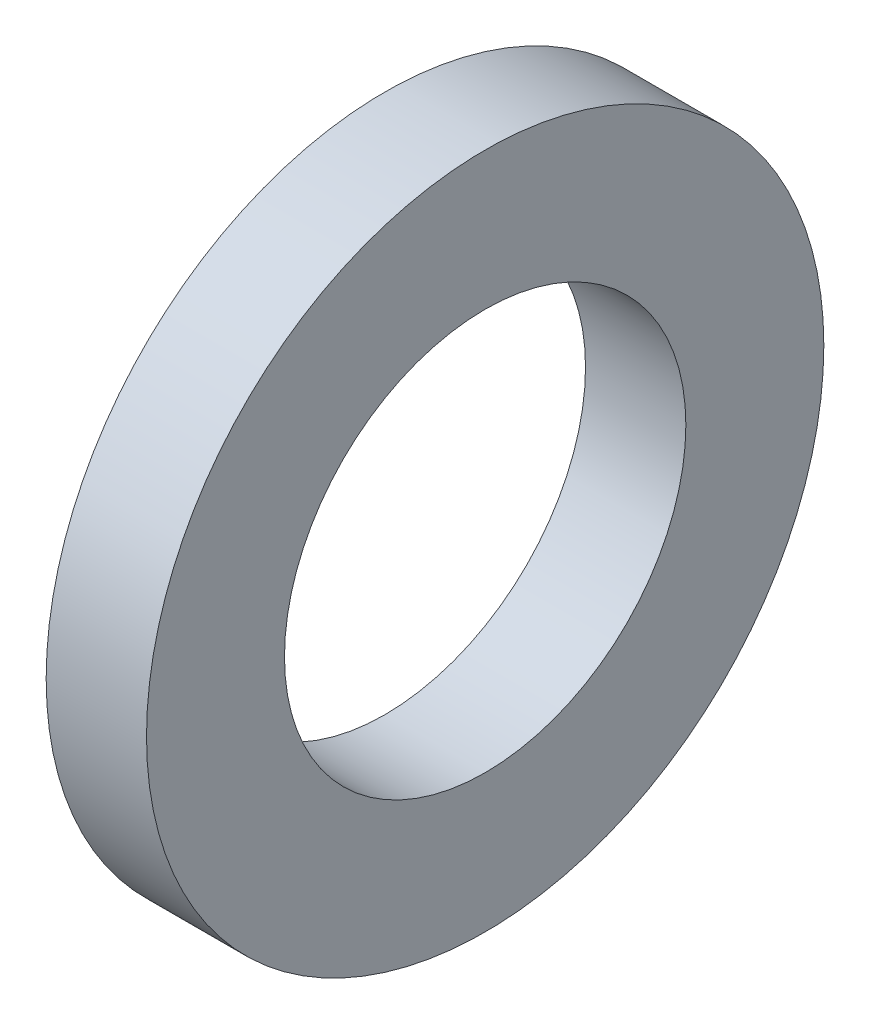
ISO-10303-21;
HEADER;
FILE_DESCRIPTION(('STEP AP214'),'2;1');
FILE_NAME('part.step','',(''),(''),'','','');
FILE_SCHEMA(('AUTOMOTIVE_DESIGN { 1 0 10303 214 1 1 1 1 }'));
ENDSEC;
DATA;
#1=APPLICATION_CONTEXT('core data for automotive mechanical design processes');
#2=APPLICATION_PROTOCOL_DEFINITION('international standard','automotive_design',2000,#1);
#3=PRODUCT_CONTEXT('',#1,'mechanical');
#4=PRODUCT('Part','Part','',(#3));
#5=PRODUCT_RELATED_PRODUCT_CATEGORY('part','',(#4));
#6=PRODUCT_DEFINITION_FORMATION('','',#4);
#7=PRODUCT_DEFINITION_CONTEXT('part definition',#1,'design');
#8=PRODUCT_DEFINITION('design','',#6,#7);
#9=PRODUCT_DEFINITION_SHAPE('','',#8);
#10=(LENGTH_UNIT() NAMED_UNIT(*) SI_UNIT(.MILLI.,.METRE.));
#11=(NAMED_UNIT(*) PLANE_ANGLE_UNIT() SI_UNIT($,.RADIAN.));
#12=(NAMED_UNIT(*) SI_UNIT($,.STERADIAN.) SOLID_ANGLE_UNIT());
#13=UNCERTAINTY_MEASURE_WITH_UNIT(LENGTH_MEASURE(1.E-05),#10,'distance_accuracy_value','');
#14=(GEOMETRIC_REPRESENTATION_CONTEXT(3) GLOBAL_UNCERTAINTY_ASSIGNED_CONTEXT((#13)) GLOBAL_UNIT_ASSIGNED_CONTEXT((#10,
#11,#12)) REPRESENTATION_CONTEXT('',''));
#15=CARTESIAN_POINT('',(0.,0.,0.));
#16=DIRECTION('',(0.,0.,1.));
#17=DIRECTION('',(1.,0.,0.));
#18=AXIS2_PLACEMENT_3D('',#15,#16,#17);
#19=CARTESIAN_POINT('',(2.,0.,0.));
#20=DIRECTION('',(-1.,0.,0.));
#21=DIRECTION('',(0.,0.,1.));
#22=AXIS2_PLACEMENT_3D('',#19,#20,#21);
#23=CYLINDRICAL_SURFACE('',#22,6.75);
#24=CARTESIAN_POINT('',(2.,0.,0.));
#25=DIRECTION('',(1.,0.,0.));
#26=DIRECTION('',(0.,0.,-1.));
#27=AXIS2_PLACEMENT_3D('',#24,#25,#26);
#28=CIRCLE('',#27,6.75);
#29=CARTESIAN_POINT('',(2.,0.,-6.75));
#30=VERTEX_POINT('',#29);
#31=EDGE_CURVE('E10',#30,#30,#28,.T.);
#32=ORIENTED_EDGE('',*,*,#31,.F.);
#33=EDGE_LOOP('',(#32));
#34=FACE_BOUND('',#33,.T.);
#35=CARTESIAN_POINT('',(0.,0.,0.));
#36=DIRECTION('',(1.,0.,0.));
#37=DIRECTION('',(0.,0.,-1.));
#38=AXIS2_PLACEMENT_3D('',#35,#36,#37);
#39=CIRCLE('',#38,6.75);
#40=CARTESIAN_POINT('',(0.,0.,-6.75));
#41=VERTEX_POINT('',#40);
#42=EDGE_CURVE('E38',#41,#41,#39,.T.);
#43=ORIENTED_EDGE('',*,*,#42,.T.);
#44=EDGE_LOOP('',(#43));
#45=FACE_BOUND('',#44,.T.);
#46=ADVANCED_FACE('F35',(#34,#45),#23,.T.);
#47=CARTESIAN_POINT('',(2.,0.,0.));
#48=DIRECTION('',(1.,0.,0.));
#49=DIRECTION('',(0.,0.,-1.));
#50=AXIS2_PLACEMENT_3D('',#47,#48,#49);
#51=PLANE('',#50);
#52=CARTESIAN_POINT('',(2.,0.,0.));
#53=DIRECTION('',(1.,0.,0.));
#54=DIRECTION('',(0.,0.,-1.));
#55=AXIS2_PLACEMENT_3D('',#52,#53,#54);
#56=CIRCLE('',#55,4.);
#57=CARTESIAN_POINT('',(2.,0.,-4.));
#58=VERTEX_POINT('',#57);
#59=EDGE_CURVE('E47',#58,#58,#56,.T.);
#60=ORIENTED_EDGE('',*,*,#59,.F.);
#61=EDGE_LOOP('',(#60));
#62=FACE_BOUND('',#61,.T.);
#63=ORIENTED_EDGE('',*,*,#31,.T.);
#64=EDGE_LOOP('',(#63));
#65=FACE_BOUND('',#64,.T.);
#66=ADVANCED_FACE('F62',(#62,#65),#51,.T.);
#67=CARTESIAN_POINT('',(0.,0.,0.));
#68=DIRECTION('',(1.,0.,0.));
#69=DIRECTION('',(0.,0.,-1.));
#70=AXIS2_PLACEMENT_3D('',#67,#68,#69);
#71=PLANE('',#70);
#72=CARTESIAN_POINT('',(0.,0.,0.));
#73=DIRECTION('',(1.,0.,0.));
#74=DIRECTION('',(0.,0.,-1.));
#75=AXIS2_PLACEMENT_3D('',#72,#73,#74);
#76=CIRCLE('',#75,4.);
#77=CARTESIAN_POINT('',(0.,0.,-4.));
#78=VERTEX_POINT('',#77);
#79=EDGE_CURVE('E45',#78,#78,#76,.T.);
#80=ORIENTED_EDGE('',*,*,#79,.T.);
#81=EDGE_LOOP('',(#80));
#82=FACE_BOUND('',#81,.T.);
#83=ORIENTED_EDGE('',*,*,#42,.F.);
#84=EDGE_LOOP('',(#83));
#85=FACE_BOUND('',#84,.T.);
#86=ADVANCED_FACE('F53',(#82,#85),#71,.F.);
#87=CARTESIAN_POINT('',(0.,0.,0.));
#88=DIRECTION('',(1.,0.,0.));
#89=DIRECTION('',(0.,0.,-1.));
#90=AXIS2_PLACEMENT_3D('',#87,#88,#89);
#91=CYLINDRICAL_SURFACE('',#90,4.);
#92=ORIENTED_EDGE('',*,*,#79,.F.);
#93=EDGE_LOOP('',(#92));
#94=FACE_BOUND('',#93,.T.);
#95=ORIENTED_EDGE('',*,*,#59,.T.);
#96=EDGE_LOOP('',(#95));
#97=FACE_BOUND('',#96,.T.);
#98=ADVANCED_FACE('F56',(#94,#97),#91,.F.);
#99=CLOSED_SHELL('',(#46,#66,#86,#98));
#100=MANIFOLD_SOLID_BREP('B2',#99);
#101=ADVANCED_BREP_SHAPE_REPRESENTATION('',(#18,#100),#14);
#102=SHAPE_DEFINITION_REPRESENTATION(#9,#101);
ENDSEC;
END-ISO-10303-21;
